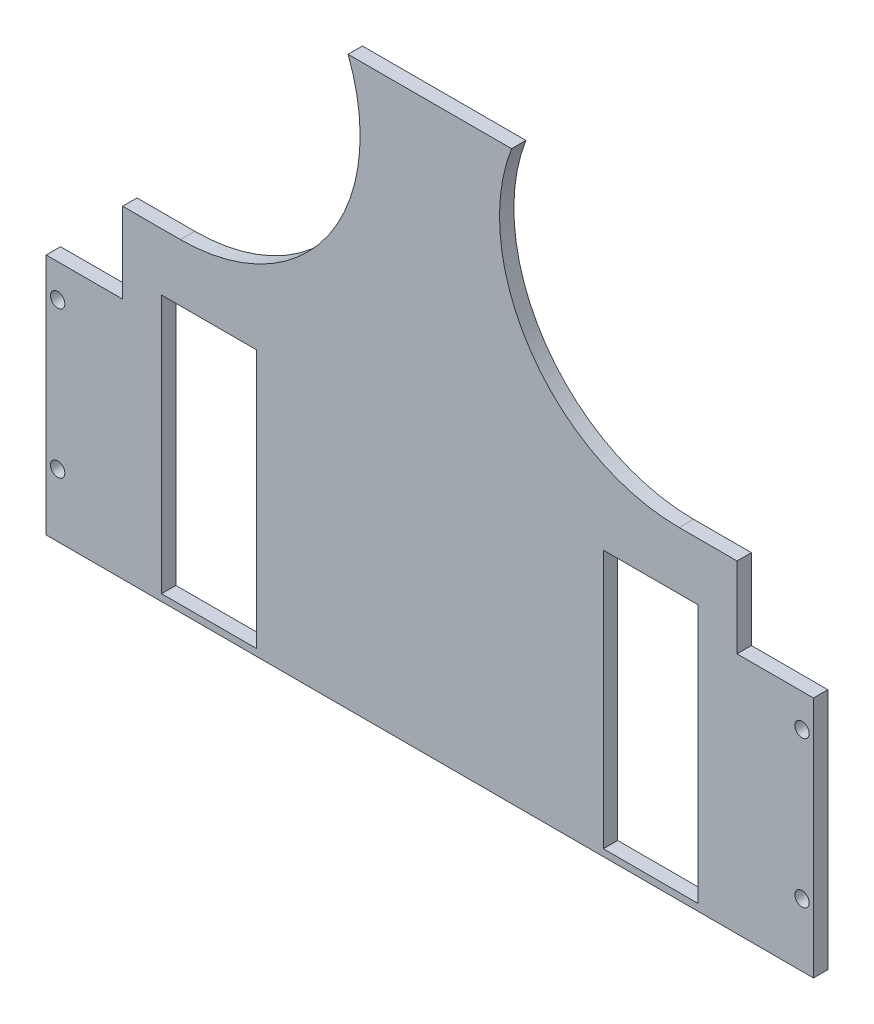
ISO-10303-21;
HEADER;
FILE_DESCRIPTION(('STEP AP214'),'2;1');
FILE_NAME('part.step','',(''),(''),'','','');
FILE_SCHEMA(('AUTOMOTIVE_DESIGN { 1 0 10303 214 1 1 1 1 }'));
ENDSEC;
DATA;
#1=APPLICATION_CONTEXT('core data for automotive mechanical design processes');
#2=APPLICATION_PROTOCOL_DEFINITION('international standard','automotive_design',2000,#1);
#3=PRODUCT_CONTEXT('',#1,'mechanical');
#4=PRODUCT('Part','Part','',(#3));
#5=PRODUCT_RELATED_PRODUCT_CATEGORY('part','',(#4));
#6=PRODUCT_DEFINITION_FORMATION('','',#4);
#7=PRODUCT_DEFINITION_CONTEXT('part definition',#1,'design');
#8=PRODUCT_DEFINITION('design','',#6,#7);
#9=PRODUCT_DEFINITION_SHAPE('','',#8);
#10=(LENGTH_UNIT() NAMED_UNIT(*) SI_UNIT(.MILLI.,.METRE.));
#11=(NAMED_UNIT(*) PLANE_ANGLE_UNIT() SI_UNIT($,.RADIAN.));
#12=(NAMED_UNIT(*) SI_UNIT($,.STERADIAN.) SOLID_ANGLE_UNIT());
#13=UNCERTAINTY_MEASURE_WITH_UNIT(LENGTH_MEASURE(1.E-05),#10,'distance_accuracy_value','');
#14=(GEOMETRIC_REPRESENTATION_CONTEXT(3) GLOBAL_UNCERTAINTY_ASSIGNED_CONTEXT((#13)) GLOBAL_UNIT_ASSIGNED_CONTEXT((#10,
#11,#12)) REPRESENTATION_CONTEXT('',''));
#15=CARTESIAN_POINT('',(0.,0.,0.));
#16=DIRECTION('',(0.,0.,1.));
#17=DIRECTION('',(1.,0.,0.));
#18=AXIS2_PLACEMENT_3D('',#15,#16,#17);
#19=CARTESIAN_POINT('',(0.,0.,5.));
#20=DIRECTION('',(0.,0.,1.));
#21=DIRECTION('',(1.,0.,0.));
#22=AXIS2_PLACEMENT_3D('',#19,#20,#21);
#23=PLANE('',#22);
#24=DIRECTION('',(1.,0.,0.));
#25=VECTOR('',#24,1.);
#26=CARTESIAN_POINT('',(-3395.60000000005,-182.000000000022,5.));
#27=LINE('',#26,#25);
#28=CARTESIAN_POINT('',(-3395.60000000005,-182.000000000022,5.));
#29=VERTEX_POINT('',#28);
#30=CARTESIAN_POINT('',(-3368.99566164202,-182.000000000022,5.));
#31=VERTEX_POINT('',#30);
#32=EDGE_CURVE('E338',#29,#31,#27,.T.);
#33=ORIENTED_EDGE('',*,*,#32,.F.);
#34=DIRECTION('',(0.,-1.,0.));
#35=VECTOR('',#34,1.);
#36=CARTESIAN_POINT('',(-3395.60000000005,-69.0000000000222,5.));
#37=LINE('',#36,#35);
#38=CARTESIAN_POINT('',(-3395.60000000005,-266.375602835039,5.));
#39=VERTEX_POINT('',#38);
#40=EDGE_CURVE('E204',#29,#39,#37,.T.);
#41=ORIENTED_EDGE('',*,*,#40,.T.);
#42=DIRECTION('',(-1.,0.,0.));
#43=VECTOR('',#42,1.);
#44=CARTESIAN_POINT('',(-3395.60000000005,-266.375602835039,5.));
#45=LINE('',#44,#43);
#46=CARTESIAN_POINT('',(-3128.60000000005,-266.375602835039,5.));
#47=VERTEX_POINT('',#46);
#48=EDGE_CURVE('E175',#47,#39,#45,.T.);
#49=ORIENTED_EDGE('',*,*,#48,.F.);
#50=DIRECTION('',(0.,1.,0.));
#51=VECTOR('',#50,1.);
#52=CARTESIAN_POINT('',(-3128.60000000005,-69.0000000000221,5.));
#53=LINE('',#52,#51);
#54=CARTESIAN_POINT('',(-3128.60000000005,-182.000000000022,5.));
#55=VERTEX_POINT('',#54);
#56=EDGE_CURVE('E44',#47,#55,#53,.T.);
#57=ORIENTED_EDGE('',*,*,#56,.T.);
#58=DIRECTION('',(1.,0.,0.));
#59=VECTOR('',#58,1.);
#60=CARTESIAN_POINT('',(-3128.60000000005,-182.000000000022,5.));
#61=LINE('',#60,#59);
#62=CARTESIAN_POINT('',(-3155.20433835807,-182.000000000022,5.));
#63=VERTEX_POINT('',#62);
#64=EDGE_CURVE('E300',#63,#55,#61,.T.);
#65=ORIENTED_EDGE('',*,*,#64,.F.);
#66=DIRECTION('',(0.,-1.,0.));
#67=VECTOR('',#66,1.);
#68=CARTESIAN_POINT('',(-3155.20433835807,-182.000000000022,5.));
#69=LINE('',#68,#67);
#70=CARTESIAN_POINT('',(-3155.20433835807,-154.000000000022,5.));
#71=VERTEX_POINT('',#70);
#72=EDGE_CURVE('E303',#71,#63,#69,.T.);
#73=ORIENTED_EDGE('',*,*,#72,.F.);
#74=DIRECTION('',(1.,0.,0.));
#75=VECTOR('',#74,1.);
#76=CARTESIAN_POINT('',(-3155.20433835807,-154.000000000022,5.));
#77=LINE('',#76,#75);
#78=CARTESIAN_POINT('',(-3175.35039250814,-154.000000000022,5.));
#79=VERTEX_POINT('',#78);
#80=EDGE_CURVE('E306',#79,#71,#77,.T.);
#81=ORIENTED_EDGE('',*,*,#80,.F.);
#82=CARTESIAN_POINT('',(-3175.35039250814,-91.5000000000222,5.));
#83=DIRECTION('',(0.,0.,1.));
#84=DIRECTION('',(-1.,0.,0.));
#85=AXIS2_PLACEMENT_3D('',#82,#83,#84);
#86=CIRCLE('',#85,62.5);
#87=CARTESIAN_POINT('',(-3233.65991145659,-69.0000000000221,5.));
#88=VERTEX_POINT('',#87);
#89=EDGE_CURVE('E180',#88,#79,#86,.T.);
#90=ORIENTED_EDGE('',*,*,#89,.F.);
#91=DIRECTION('',(-1.,0.,0.));
#92=VECTOR('',#91,1.);
#93=CARTESIAN_POINT('',(-3395.60000000005,-69.0000000000222,5.));
#94=LINE('',#93,#92);
#95=CARTESIAN_POINT('',(-3290.5400885435,-69.0000000000221,5.));
#96=VERTEX_POINT('',#95);
#97=EDGE_CURVE('E11',#88,#96,#94,.T.);
#98=ORIENTED_EDGE('',*,*,#97,.T.);
#99=CARTESIAN_POINT('',(-3348.84960749195,-91.5000000000221,5.));
#100=DIRECTION('',(0.,0.,1.));
#101=DIRECTION('',(1.,0.,0.));
#102=AXIS2_PLACEMENT_3D('',#99,#100,#101);
#103=CIRCLE('',#102,62.5);
#104=CARTESIAN_POINT('',(-3348.84960749195,-154.000000000022,5.));
#105=VERTEX_POINT('',#104);
#106=EDGE_CURVE('E60',#105,#96,#103,.T.);
#107=ORIENTED_EDGE('',*,*,#106,.F.);
#108=DIRECTION('',(1.,0.,0.));
#109=VECTOR('',#108,1.);
#110=CARTESIAN_POINT('',(-3368.99566164202,-154.000000000022,5.));
#111=LINE('',#110,#109);
#112=CARTESIAN_POINT('',(-3368.99566164202,-154.000000000022,5.));
#113=VERTEX_POINT('',#112);
#114=EDGE_CURVE('E332',#113,#105,#111,.T.);
#115=ORIENTED_EDGE('',*,*,#114,.F.);
#116=DIRECTION('',(0.,1.,0.));
#117=VECTOR('',#116,1.);
#118=CARTESIAN_POINT('',(-3368.99566164202,-182.000000000022,5.));
#119=LINE('',#118,#117);
#120=EDGE_CURVE('E335',#31,#113,#119,.T.);
#121=ORIENTED_EDGE('',*,*,#120,.F.);
#122=EDGE_LOOP('',(#33,#41,#49,#57,#65,#73,#81,#90,#98,#107,#115,#121));
#123=FACE_BOUND('',#122,.T.);
#124=CARTESIAN_POINT('',(-3391.60000000005,-244.500000000019,5.));
#125=DIRECTION('',(0.,0.,1.));
#126=DIRECTION('',(-1.,0.,0.));
#127=AXIS2_PLACEMENT_3D('',#124,#125,#126);
#128=CIRCLE('',#127,2.50000000000012);
#129=CARTESIAN_POINT('',(-3394.10000000005,-244.500000000019,5.));
#130=VERTEX_POINT('',#129);
#131=EDGE_CURVE('E243',#130,#130,#128,.T.);
#132=ORIENTED_EDGE('',*,*,#131,.F.);
#133=EDGE_LOOP('',(#132));
#134=FACE_BOUND('',#133,.T.);
#135=CARTESIAN_POINT('',(-3132.60000000005,-193.500000000019,5.));
#136=DIRECTION('',(0.,0.,1.));
#137=DIRECTION('',(1.,0.,0.));
#138=AXIS2_PLACEMENT_3D('',#135,#136,#137);
#139=CIRCLE('',#138,2.50000000000012);
#140=CARTESIAN_POINT('',(-3130.10000000005,-193.500000000019,5.));
#141=VERTEX_POINT('',#140);
#142=EDGE_CURVE('E226',#141,#141,#139,.T.);
#143=ORIENTED_EDGE('',*,*,#142,.F.);
#144=EDGE_LOOP('',(#143));
#145=FACE_BOUND('',#144,.T.);
#146=DIRECTION('',(1.,0.,0.));
#147=VECTOR('',#146,1.);
#148=CARTESIAN_POINT('',(-3201.74000000005,-264.00000000002,5.));
#149=LINE('',#148,#147);
#150=CARTESIAN_POINT('',(-3201.74000000005,-264.00000000002,5.));
#151=VERTEX_POINT('',#150);
#152=CARTESIAN_POINT('',(-3168.74000000005,-264.00000000002,5.));
#153=VERTEX_POINT('',#152);
#154=EDGE_CURVE('E231',#151,#153,#149,.T.);
#155=ORIENTED_EDGE('',*,*,#154,.F.);
#156=DIRECTION('',(0.,-1.,0.));
#157=VECTOR('',#156,1.);
#158=CARTESIAN_POINT('',(-3201.74000000005,-174.000000000017,5.));
#159=LINE('',#158,#157);
#160=CARTESIAN_POINT('',(-3201.74000000005,-174.000000000017,5.));
#161=VERTEX_POINT('',#160);
#162=EDGE_CURVE('E216',#161,#151,#159,.T.);
#163=ORIENTED_EDGE('',*,*,#162,.F.);
#164=DIRECTION('',(-1.,1.02611521972931E-13,0.));
#165=VECTOR('',#164,1.);
#166=CARTESIAN_POINT('',(-3201.74000000005,-174.000000000017,5.));
#167=LINE('',#166,#165);
#168=CARTESIAN_POINT('',(-3168.74000000005,-174.00000000002,5.));
#169=VERTEX_POINT('',#168);
#170=EDGE_CURVE('E212',#169,#161,#167,.T.);
#171=ORIENTED_EDGE('',*,*,#170,.F.);
#172=DIRECTION('',(0.,1.,0.));
#173=VECTOR('',#172,1.);
#174=CARTESIAN_POINT('',(-3168.74000000005,-174.00000000002,5.));
#175=LINE('',#174,#173);
#176=EDGE_CURVE('E228',#153,#169,#175,.T.);
#177=ORIENTED_EDGE('',*,*,#176,.F.);
#178=EDGE_LOOP('',(#155,#163,#171,#177));
#179=FACE_BOUND('',#178,.T.);
#180=CARTESIAN_POINT('',(-3132.60000000005,-244.500000000019,5.));
#181=DIRECTION('',(0.,0.,1.));
#182=DIRECTION('',(1.,0.,0.));
#183=AXIS2_PLACEMENT_3D('',#180,#181,#182);
#184=CIRCLE('',#183,2.50000000000012);
#185=CARTESIAN_POINT('',(-3130.10000000005,-244.500000000019,5.));
#186=VERTEX_POINT('',#185);
#187=EDGE_CURVE('E237',#186,#186,#184,.T.);
#188=ORIENTED_EDGE('',*,*,#187,.F.);
#189=EDGE_LOOP('',(#188));
#190=FACE_BOUND('',#189,.T.);
#191=CARTESIAN_POINT('',(-3391.60000000005,-193.500000000019,5.));
#192=DIRECTION('',(0.,0.,1.));
#193=DIRECTION('',(-1.,0.,0.));
#194=AXIS2_PLACEMENT_3D('',#191,#192,#193);
#195=CIRCLE('',#194,2.50000000000012);
#196=CARTESIAN_POINT('',(-3394.10000000005,-193.500000000019,5.));
#197=VERTEX_POINT('',#196);
#198=EDGE_CURVE('E249',#197,#197,#195,.T.);
#199=ORIENTED_EDGE('',*,*,#198,.F.);
#200=EDGE_LOOP('',(#199));
#201=FACE_BOUND('',#200,.T.);
#202=DIRECTION('',(0.,-1.,0.));
#203=VECTOR('',#202,1.);
#204=CARTESIAN_POINT('',(-3355.46000000005,-174.00000000002,5.));
#205=LINE('',#204,#203);
#206=CARTESIAN_POINT('',(-3355.46000000005,-174.00000000002,5.));
#207=VERTEX_POINT('',#206);
#208=CARTESIAN_POINT('',(-3355.46000000005,-264.000000000017,5.));
#209=VERTEX_POINT('',#208);
#210=EDGE_CURVE('E286',#207,#209,#205,.T.);
#211=ORIENTED_EDGE('',*,*,#210,.F.);
#212=DIRECTION('',(-1.,-1.02611521972931E-13,0.));
#213=VECTOR('',#212,1.);
#214=CARTESIAN_POINT('',(-3322.46000000005,-174.000000000017,5.));
#215=LINE('',#214,#213);
#216=CARTESIAN_POINT('',(-3322.46000000005,-174.000000000017,5.));
#217=VERTEX_POINT('',#216);
#218=EDGE_CURVE('E271',#217,#207,#215,.T.);
#219=ORIENTED_EDGE('',*,*,#218,.F.);
#220=DIRECTION('',(0.,1.,0.));
#221=VECTOR('',#220,1.);
#222=CARTESIAN_POINT('',(-3322.46000000005,-174.000000000017,5.));
#223=LINE('',#222,#221);
#224=CARTESIAN_POINT('',(-3322.46000000005,-264.00000000002,5.));
#225=VERTEX_POINT('',#224);
#226=EDGE_CURVE('E267',#225,#217,#223,.T.);
#227=ORIENTED_EDGE('',*,*,#226,.F.);
#228=DIRECTION('',(1.,-1.04293678070848E-13,0.));
#229=VECTOR('',#228,1.);
#230=CARTESIAN_POINT('',(-3322.46000000005,-264.00000000002,5.));
#231=LINE('',#230,#229);
#232=EDGE_CURVE('E283',#209,#225,#231,.T.);
#233=ORIENTED_EDGE('',*,*,#232,.F.);
#234=EDGE_LOOP('',(#211,#219,#227,#233));
#235=FACE_BOUND('',#234,.T.);
#236=ADVANCED_FACE('F35',(#123,#134,#145,#179,#190,#201,#235),#23,.T.);
#237=CARTESIAN_POINT('',(0.,0.,0.));
#238=DIRECTION('',(0.,0.,1.));
#239=DIRECTION('',(1.,0.,0.));
#240=AXIS2_PLACEMENT_3D('',#237,#238,#239);
#241=PLANE('',#240);
#242=DIRECTION('',(0.,-1.,0.));
#243=VECTOR('',#242,1.);
#244=CARTESIAN_POINT('',(-3395.60000000005,-69.0000000000222,0.));
#245=LINE('',#244,#243);
#246=CARTESIAN_POINT('',(-3395.60000000005,-182.000000000022,0.));
#247=VERTEX_POINT('',#246);
#248=CARTESIAN_POINT('',(-3395.60000000005,-266.375602835039,0.));
#249=VERTEX_POINT('',#248);
#250=EDGE_CURVE('E189',#247,#249,#245,.T.);
#251=ORIENTED_EDGE('',*,*,#250,.F.);
#252=DIRECTION('',(1.,0.,0.));
#253=VECTOR('',#252,1.);
#254=CARTESIAN_POINT('',(-3395.60000000005,-182.000000000022,0.));
#255=LINE('',#254,#253);
#256=CARTESIAN_POINT('',(-3368.99566164202,-182.000000000022,0.));
#257=VERTEX_POINT('',#256);
#258=EDGE_CURVE('E331',#247,#257,#255,.T.);
#259=ORIENTED_EDGE('',*,*,#258,.T.);
#260=DIRECTION('',(0.,1.,0.));
#261=VECTOR('',#260,1.);
#262=CARTESIAN_POINT('',(-3368.99566164202,-182.000000000022,0.));
#263=LINE('',#262,#261);
#264=CARTESIAN_POINT('',(-3368.99566164202,-154.000000000022,0.));
#265=VERTEX_POINT('',#264);
#266=EDGE_CURVE('E346',#257,#265,#263,.T.);
#267=ORIENTED_EDGE('',*,*,#266,.T.);
#268=DIRECTION('',(1.,0.,0.));
#269=VECTOR('',#268,1.);
#270=CARTESIAN_POINT('',(-3368.99566164202,-154.000000000022,0.));
#271=LINE('',#270,#269);
#272=CARTESIAN_POINT('',(-3348.84960749195,-154.000000000022,0.));
#273=VERTEX_POINT('',#272);
#274=EDGE_CURVE('E343',#265,#273,#271,.T.);
#275=ORIENTED_EDGE('',*,*,#274,.T.);
#276=CARTESIAN_POINT('',(-3348.84960749195,-91.5000000000221,0.));
#277=DIRECTION('',(0.,0.,1.));
#278=DIRECTION('',(1.,0.,0.));
#279=AXIS2_PLACEMENT_3D('',#276,#277,#278);
#280=CIRCLE('',#279,62.5);
#281=CARTESIAN_POINT('',(-3290.5400885435,-69.0000000000221,0.));
#282=VERTEX_POINT('',#281);
#283=EDGE_CURVE('E323',#273,#282,#280,.T.);
#284=ORIENTED_EDGE('',*,*,#283,.T.);
#285=DIRECTION('',(-1.,0.,0.));
#286=VECTOR('',#285,1.);
#287=CARTESIAN_POINT('',(-3395.60000000005,-69.0000000000222,0.));
#288=LINE('',#287,#286);
#289=CARTESIAN_POINT('',(-3233.65991145659,-69.0000000000221,0.));
#290=VERTEX_POINT('',#289);
#291=EDGE_CURVE('E39',#290,#282,#288,.T.);
#292=ORIENTED_EDGE('',*,*,#291,.F.);
#293=CARTESIAN_POINT('',(-3175.35039250814,-91.5000000000222,0.));
#294=DIRECTION('',(0.,0.,1.));
#295=DIRECTION('',(-1.,0.,0.));
#296=AXIS2_PLACEMENT_3D('',#293,#294,#295);
#297=CIRCLE('',#296,62.5);
#298=CARTESIAN_POINT('',(-3175.35039250814,-154.000000000022,0.));
#299=VERTEX_POINT('',#298);
#300=EDGE_CURVE('E302',#290,#299,#297,.T.);
#301=ORIENTED_EDGE('',*,*,#300,.T.);
#302=DIRECTION('',(1.,0.,0.));
#303=VECTOR('',#302,1.);
#304=CARTESIAN_POINT('',(-3155.20433835807,-154.000000000022,0.));
#305=LINE('',#304,#303);
#306=CARTESIAN_POINT('',(-3155.20433835807,-154.000000000022,0.));
#307=VERTEX_POINT('',#306);
#308=EDGE_CURVE('E315',#299,#307,#305,.T.);
#309=ORIENTED_EDGE('',*,*,#308,.T.);
#310=DIRECTION('',(0.,-1.,0.));
#311=VECTOR('',#310,1.);
#312=CARTESIAN_POINT('',(-3155.20433835807,-182.000000000022,0.));
#313=LINE('',#312,#311);
#314=CARTESIAN_POINT('',(-3155.20433835807,-182.000000000022,0.));
#315=VERTEX_POINT('',#314);
#316=EDGE_CURVE('E312',#307,#315,#313,.T.);
#317=ORIENTED_EDGE('',*,*,#316,.T.);
#318=DIRECTION('',(1.,0.,0.));
#319=VECTOR('',#318,1.);
#320=CARTESIAN_POINT('',(-3128.60000000005,-182.000000000022,0.));
#321=LINE('',#320,#319);
#322=CARTESIAN_POINT('',(-3128.60000000005,-182.000000000022,0.));
#323=VERTEX_POINT('',#322);
#324=EDGE_CURVE('E292',#315,#323,#321,.T.);
#325=ORIENTED_EDGE('',*,*,#324,.T.);
#326=DIRECTION('',(0.,1.,0.));
#327=VECTOR('',#326,1.);
#328=CARTESIAN_POINT('',(-3128.60000000005,-69.0000000000221,0.));
#329=LINE('',#328,#327);
#330=CARTESIAN_POINT('',(-3128.60000000005,-266.375602835039,0.));
#331=VERTEX_POINT('',#330);
#332=EDGE_CURVE('E192',#331,#323,#329,.T.);
#333=ORIENTED_EDGE('',*,*,#332,.F.);
#334=DIRECTION('',(-1.,0.,0.));
#335=VECTOR('',#334,1.);
#336=CARTESIAN_POINT('',(-3395.60000000005,-266.375602835039,0.));
#337=LINE('',#336,#335);
#338=EDGE_CURVE('E52',#331,#249,#337,.T.);
#339=ORIENTED_EDGE('',*,*,#338,.T.);
#340=EDGE_LOOP('',(#251,#259,#267,#275,#284,#292,#301,#309,#317,#325,#333,#339));
#341=FACE_BOUND('',#340,.T.);
#342=CARTESIAN_POINT('',(-3391.60000000005,-193.500000000019,0.));
#343=DIRECTION('',(0.,0.,1.));
#344=DIRECTION('',(-1.,0.,0.));
#345=AXIS2_PLACEMENT_3D('',#342,#343,#344);
#346=CIRCLE('',#345,2.50000000000012);
#347=CARTESIAN_POINT('',(-3394.10000000005,-193.500000000019,0.));
#348=VERTEX_POINT('',#347);
#349=EDGE_CURVE('E252',#348,#348,#346,.T.);
#350=ORIENTED_EDGE('',*,*,#349,.T.);
#351=EDGE_LOOP('',(#350));
#352=FACE_BOUND('',#351,.T.);
#353=CARTESIAN_POINT('',(-3391.60000000005,-244.500000000019,0.));
#354=DIRECTION('',(0.,0.,1.));
#355=DIRECTION('',(-1.,0.,0.));
#356=AXIS2_PLACEMENT_3D('',#353,#354,#355);
#357=CIRCLE('',#356,2.50000000000012);
#358=CARTESIAN_POINT('',(-3394.10000000005,-244.500000000019,0.));
#359=VERTEX_POINT('',#358);
#360=EDGE_CURVE('E246',#359,#359,#357,.T.);
#361=ORIENTED_EDGE('',*,*,#360,.T.);
#362=EDGE_LOOP('',(#361));
#363=FACE_BOUND('',#362,.T.);
#364=CARTESIAN_POINT('',(-3132.60000000005,-244.500000000019,0.));
#365=DIRECTION('',(0.,0.,1.));
#366=DIRECTION('',(1.,0.,0.));
#367=AXIS2_PLACEMENT_3D('',#364,#365,#366);
#368=CIRCLE('',#367,2.50000000000012);
#369=CARTESIAN_POINT('',(-3130.10000000005,-244.500000000019,0.));
#370=VERTEX_POINT('',#369);
#371=EDGE_CURVE('E240',#370,#370,#368,.T.);
#372=ORIENTED_EDGE('',*,*,#371,.T.);
#373=EDGE_LOOP('',(#372));
#374=FACE_BOUND('',#373,.T.);
#375=CARTESIAN_POINT('',(-3132.60000000005,-193.500000000019,0.));
#376=DIRECTION('',(0.,0.,1.));
#377=DIRECTION('',(1.,0.,0.));
#378=AXIS2_PLACEMENT_3D('',#375,#376,#377);
#379=CIRCLE('',#378,2.50000000000012);
#380=CARTESIAN_POINT('',(-3130.10000000005,-193.500000000019,0.));
#381=VERTEX_POINT('',#380);
#382=EDGE_CURVE('E234',#381,#381,#379,.T.);
#383=ORIENTED_EDGE('',*,*,#382,.T.);
#384=EDGE_LOOP('',(#383));
#385=FACE_BOUND('',#384,.T.);
#386=DIRECTION('',(0.,-1.,0.));
#387=VECTOR('',#386,1.);
#388=CARTESIAN_POINT('',(-3201.74000000005,-174.000000000017,0.));
#389=LINE('',#388,#387);
#390=CARTESIAN_POINT('',(-3201.74000000005,-174.000000000017,0.));
#391=VERTEX_POINT('',#390);
#392=CARTESIAN_POINT('',(-3201.74000000005,-264.00000000002,0.));
#393=VERTEX_POINT('',#392);
#394=EDGE_CURVE('E223',#391,#393,#389,.T.);
#395=ORIENTED_EDGE('',*,*,#394,.T.);
#396=DIRECTION('',(1.,0.,0.));
#397=VECTOR('',#396,1.);
#398=CARTESIAN_POINT('',(-3201.74000000005,-264.00000000002,0.));
#399=LINE('',#398,#397);
#400=CARTESIAN_POINT('',(-3168.74000000005,-264.00000000002,0.));
#401=VERTEX_POINT('',#400);
#402=EDGE_CURVE('E220',#393,#401,#399,.T.);
#403=ORIENTED_EDGE('',*,*,#402,.T.);
#404=DIRECTION('',(0.,1.,0.));
#405=VECTOR('',#404,1.);
#406=CARTESIAN_POINT('',(-3168.74000000005,-174.00000000002,0.));
#407=LINE('',#406,#405);
#408=CARTESIAN_POINT('',(-3168.74000000005,-174.00000000002,0.));
#409=VERTEX_POINT('',#408);
#410=EDGE_CURVE('E217',#401,#409,#407,.T.);
#411=ORIENTED_EDGE('',*,*,#410,.T.);
#412=DIRECTION('',(-1.,1.02611521972931E-13,0.));
#413=VECTOR('',#412,1.);
#414=CARTESIAN_POINT('',(-3201.74000000005,-174.000000000017,0.));
#415=LINE('',#414,#413);
#416=EDGE_CURVE('E213',#409,#391,#415,.T.);
#417=ORIENTED_EDGE('',*,*,#416,.T.);
#418=EDGE_LOOP('',(#395,#403,#411,#417));
#419=FACE_BOUND('',#418,.T.);
#420=DIRECTION('',(-1.,-1.02611521972931E-13,0.));
#421=VECTOR('',#420,1.);
#422=CARTESIAN_POINT('',(-3322.46000000005,-174.000000000017,0.));
#423=LINE('',#422,#421);
#424=CARTESIAN_POINT('',(-3322.46000000005,-174.000000000017,0.));
#425=VERTEX_POINT('',#424);
#426=CARTESIAN_POINT('',(-3355.46000000005,-174.00000000002,0.));
#427=VERTEX_POINT('',#426);
#428=EDGE_CURVE('E278',#425,#427,#423,.T.);
#429=ORIENTED_EDGE('',*,*,#428,.T.);
#430=DIRECTION('',(0.,-1.,0.));
#431=VECTOR('',#430,1.);
#432=CARTESIAN_POINT('',(-3355.46000000005,-174.00000000002,0.));
#433=LINE('',#432,#431);
#434=CARTESIAN_POINT('',(-3355.46000000005,-264.000000000017,0.));
#435=VERTEX_POINT('',#434);
#436=EDGE_CURVE('E275',#427,#435,#433,.T.);
#437=ORIENTED_EDGE('',*,*,#436,.T.);
#438=DIRECTION('',(1.,-1.04293678070848E-13,0.));
#439=VECTOR('',#438,1.);
#440=CARTESIAN_POINT('',(-3322.46000000005,-264.00000000002,0.));
#441=LINE('',#440,#439);
#442=CARTESIAN_POINT('',(-3322.46000000005,-264.00000000002,0.));
#443=VERTEX_POINT('',#442);
#444=EDGE_CURVE('E272',#435,#443,#441,.T.);
#445=ORIENTED_EDGE('',*,*,#444,.T.);
#446=DIRECTION('',(0.,1.,0.));
#447=VECTOR('',#446,1.);
#448=CARTESIAN_POINT('',(-3322.46000000005,-174.000000000017,0.));
#449=LINE('',#448,#447);
#450=EDGE_CURVE('E268',#443,#425,#449,.T.);
#451=ORIENTED_EDGE('',*,*,#450,.T.);
#452=EDGE_LOOP('',(#429,#437,#445,#451));
#453=FACE_BOUND('',#452,.T.);
#454=ADVANCED_FACE('F186',(#341,#352,#363,#374,#385,#419,#453),#241,.F.);
#455=CARTESIAN_POINT('',(-3395.60000000005,-69.0000000000222,5.));
#456=DIRECTION('',(1.,0.,0.));
#457=DIRECTION('',(0.,0.,-1.));
#458=AXIS2_PLACEMENT_3D('',#455,#456,#457);
#459=PLANE('',#458);
#460=ORIENTED_EDGE('',*,*,#40,.F.);
#461=DIRECTION('',(0.,0.,1.));
#462=VECTOR('',#461,1.);
#463=CARTESIAN_POINT('',(-3395.60000000005,-182.000000000022,0.));
#464=LINE('',#463,#462);
#465=EDGE_CURVE('E195',#247,#29,#464,.T.);
#466=ORIENTED_EDGE('',*,*,#465,.F.);
#467=ORIENTED_EDGE('',*,*,#250,.T.);
#468=DIRECTION('',(0.,0.,1.));
#469=VECTOR('',#468,1.);
#470=CARTESIAN_POINT('',(-3395.60000000005,-266.375602835039,0.));
#471=LINE('',#470,#469);
#472=EDGE_CURVE('E172',#249,#39,#471,.T.);
#473=ORIENTED_EDGE('',*,*,#472,.T.);
#474=EDGE_LOOP('',(#460,#466,#467,#473));
#475=FACE_BOUND('',#474,.T.);
#476=ADVANCED_FACE('F37',(#475),#459,.F.);
#477=CARTESIAN_POINT('',(-3128.60000000005,-69.0000000000221,5.));
#478=DIRECTION('',(-1.,0.,0.));
#479=DIRECTION('',(0.,0.,1.));
#480=AXIS2_PLACEMENT_3D('',#477,#478,#479);
#481=PLANE('',#480);
#482=ORIENTED_EDGE('',*,*,#56,.F.);
#483=DIRECTION('',(0.,0.,1.));
#484=VECTOR('',#483,1.);
#485=CARTESIAN_POINT('',(-3128.60000000005,-266.375602835039,0.));
#486=LINE('',#485,#484);
#487=EDGE_CURVE('E181',#331,#47,#486,.T.);
#488=ORIENTED_EDGE('',*,*,#487,.F.);
#489=ORIENTED_EDGE('',*,*,#332,.T.);
#490=DIRECTION('',(0.,0.,1.));
#491=VECTOR('',#490,1.);
#492=CARTESIAN_POINT('',(-3128.60000000005,-182.000000000022,0.));
#493=LINE('',#492,#491);
#494=EDGE_CURVE('E296',#323,#55,#493,.T.);
#495=ORIENTED_EDGE('',*,*,#494,.T.);
#496=EDGE_LOOP('',(#482,#488,#489,#495));
#497=FACE_BOUND('',#496,.T.);
#498=ADVANCED_FACE('F357',(#497),#481,.F.);
#499=CARTESIAN_POINT('',(-3395.60000000005,-69.0000000000222,5.));
#500=DIRECTION('',(0.,-1.,0.));
#501=DIRECTION('',(1.,0.,0.));
#502=AXIS2_PLACEMENT_3D('',#499,#500,#501);
#503=PLANE('',#502);
#504=ORIENTED_EDGE('',*,*,#291,.T.);
#505=DIRECTION('',(0.,0.,1.));
#506=VECTOR('',#505,1.);
#507=CARTESIAN_POINT('',(-3290.5400885435,-69.0000000000221,0.));
#508=LINE('',#507,#506);
#509=EDGE_CURVE('E327',#282,#96,#508,.T.);
#510=ORIENTED_EDGE('',*,*,#509,.T.);
#511=ORIENTED_EDGE('',*,*,#97,.F.);
#512=DIRECTION('',(0.,0.,1.));
#513=VECTOR('',#512,1.);
#514=CARTESIAN_POINT('',(-3233.65991145659,-69.0000000000221,0.));
#515=LINE('',#514,#513);
#516=EDGE_CURVE('E281',#290,#88,#515,.T.);
#517=ORIENTED_EDGE('',*,*,#516,.F.);
#518=EDGE_LOOP('',(#504,#510,#511,#517));
#519=FACE_BOUND('',#518,.T.);
#520=ADVANCED_FACE('F377',(#519),#503,.F.);
#521=CARTESIAN_POINT('',(-3201.74000000005,-174.000000000017,5.));
#522=DIRECTION('',(1.,0.,0.));
#523=DIRECTION('',(0.,0.,-1.));
#524=AXIS2_PLACEMENT_3D('',#521,#522,#523);
#525=PLANE('',#524);
#526=ORIENTED_EDGE('',*,*,#394,.F.);
#527=DIRECTION('',(0.,0.,-1.));
#528=VECTOR('',#527,1.);
#529=CARTESIAN_POINT('',(-3201.74000000005,-174.000000000017,5.));
#530=LINE('',#529,#528);
#531=EDGE_CURVE('E209',#161,#391,#530,.T.);
#532=ORIENTED_EDGE('',*,*,#531,.F.);
#533=ORIENTED_EDGE('',*,*,#162,.T.);
#534=DIRECTION('',(0.,0.,-1.));
#535=VECTOR('',#534,1.);
#536=CARTESIAN_POINT('',(-3201.74000000005,-264.00000000002,5.));
#537=LINE('',#536,#535);
#538=EDGE_CURVE('E196',#151,#393,#537,.T.);
#539=ORIENTED_EDGE('',*,*,#538,.T.);
#540=EDGE_LOOP('',(#526,#532,#533,#539));
#541=FACE_BOUND('',#540,.T.);
#542=ADVANCED_FACE('F407',(#541),#525,.T.);
#543=CARTESIAN_POINT('',(-3201.74000000005,-264.00000000002,5.));
#544=DIRECTION('',(0.,1.,0.));
#545=DIRECTION('',(0.,0.,1.));
#546=AXIS2_PLACEMENT_3D('',#543,#544,#545);
#547=PLANE('',#546);
#548=ORIENTED_EDGE('',*,*,#402,.F.);
#549=ORIENTED_EDGE('',*,*,#538,.F.);
#550=ORIENTED_EDGE('',*,*,#154,.T.);
#551=DIRECTION('',(0.,0.,-1.));
#552=VECTOR('',#551,1.);
#553=CARTESIAN_POINT('',(-3168.74000000005,-264.00000000002,5.));
#554=LINE('',#553,#552);
#555=EDGE_CURVE('E199',#153,#401,#554,.T.);
#556=ORIENTED_EDGE('',*,*,#555,.T.);
#557=EDGE_LOOP('',(#548,#549,#550,#556));
#558=FACE_BOUND('',#557,.T.);
#559=ADVANCED_FACE('F527',(#558),#547,.T.);
#560=CARTESIAN_POINT('',(-3168.74000000005,-174.00000000002,5.));
#561=DIRECTION('',(-1.,0.,0.));
#562=DIRECTION('',(0.,0.,1.));
#563=AXIS2_PLACEMENT_3D('',#560,#561,#562);
#564=PLANE('',#563);
#565=ORIENTED_EDGE('',*,*,#410,.F.);
#566=ORIENTED_EDGE('',*,*,#555,.F.);
#567=ORIENTED_EDGE('',*,*,#176,.T.);
#568=DIRECTION('',(0.,0.,-1.));
#569=VECTOR('',#568,1.);
#570=CARTESIAN_POINT('',(-3168.74000000005,-174.00000000002,5.));
#571=LINE('',#570,#569);
#572=EDGE_CURVE('E207',#169,#409,#571,.T.);
#573=ORIENTED_EDGE('',*,*,#572,.T.);
#574=EDGE_LOOP('',(#565,#566,#567,#573));
#575=FACE_BOUND('',#574,.T.);
#576=ADVANCED_FACE('F517',(#575),#564,.T.);
#577=CARTESIAN_POINT('',(-3201.74000000005,-174.000000000017,5.));
#578=DIRECTION('',(-1.02611521972931E-13,-1.,0.));
#579=DIRECTION('',(1.,-1.02611521972931E-13,0.));
#580=AXIS2_PLACEMENT_3D('',#577,#578,#579);
#581=PLANE('',#580);
#582=ORIENTED_EDGE('',*,*,#416,.F.);
#583=ORIENTED_EDGE('',*,*,#572,.F.);
#584=ORIENTED_EDGE('',*,*,#170,.T.);
#585=ORIENTED_EDGE('',*,*,#531,.T.);
#586=EDGE_LOOP('',(#582,#583,#584,#585));
#587=FACE_BOUND('',#586,.T.);
#588=ADVANCED_FACE('F507',(#587),#581,.T.);
#589=CARTESIAN_POINT('',(-3132.60000000005,-193.500000000019,5.));
#590=DIRECTION('',(0.,0.,-1.));
#591=DIRECTION('',(-1.,0.,0.));
#592=AXIS2_PLACEMENT_3D('',#589,#590,#591);
#593=CYLINDRICAL_SURFACE('',#592,2.50000000000012);
#594=ORIENTED_EDGE('',*,*,#142,.T.);
#595=EDGE_LOOP('',(#594));
#596=FACE_BOUND('',#595,.T.);
#597=ORIENTED_EDGE('',*,*,#382,.F.);
#598=EDGE_LOOP('',(#597));
#599=FACE_BOUND('',#598,.T.);
#600=ADVANCED_FACE('F497',(#596,#599),#593,.F.);
#601=CARTESIAN_POINT('',(-3132.60000000005,-244.500000000019,5.));
#602=DIRECTION('',(0.,0.,-1.));
#603=DIRECTION('',(-1.,0.,0.));
#604=AXIS2_PLACEMENT_3D('',#601,#602,#603);
#605=CYLINDRICAL_SURFACE('',#604,2.50000000000012);
#606=ORIENTED_EDGE('',*,*,#187,.T.);
#607=EDGE_LOOP('',(#606));
#608=FACE_BOUND('',#607,.T.);
#609=ORIENTED_EDGE('',*,*,#371,.F.);
#610=EDGE_LOOP('',(#609));
#611=FACE_BOUND('',#610,.T.);
#612=ADVANCED_FACE('F487',(#608,#611),#605,.F.);
#613=CARTESIAN_POINT('',(-3391.60000000005,-244.500000000019,5.));
#614=DIRECTION('',(0.,0.,-1.));
#615=DIRECTION('',(-1.,0.,0.));
#616=AXIS2_PLACEMENT_3D('',#613,#614,#615);
#617=CYLINDRICAL_SURFACE('',#616,2.50000000000012);
#618=ORIENTED_EDGE('',*,*,#131,.T.);
#619=EDGE_LOOP('',(#618));
#620=FACE_BOUND('',#619,.T.);
#621=ORIENTED_EDGE('',*,*,#360,.F.);
#622=EDGE_LOOP('',(#621));
#623=FACE_BOUND('',#622,.T.);
#624=ADVANCED_FACE('F477',(#620,#623),#617,.F.);
#625=CARTESIAN_POINT('',(-3391.60000000005,-193.500000000019,5.));
#626=DIRECTION('',(0.,0.,-1.));
#627=DIRECTION('',(-1.,0.,0.));
#628=AXIS2_PLACEMENT_3D('',#625,#626,#627);
#629=CYLINDRICAL_SURFACE('',#628,2.50000000000012);
#630=ORIENTED_EDGE('',*,*,#198,.T.);
#631=EDGE_LOOP('',(#630));
#632=FACE_BOUND('',#631,.T.);
#633=ORIENTED_EDGE('',*,*,#349,.F.);
#634=EDGE_LOOP('',(#633));
#635=FACE_BOUND('',#634,.T.);
#636=ADVANCED_FACE('F467',(#632,#635),#629,.F.);
#637=CARTESIAN_POINT('',(-3322.46000000005,-174.000000000017,5.));
#638=DIRECTION('',(1.02611521972931E-13,-1.,0.));
#639=DIRECTION('',(1.,1.02611521972931E-13,0.));
#640=AXIS2_PLACEMENT_3D('',#637,#638,#639);
#641=PLANE('',#640);
#642=ORIENTED_EDGE('',*,*,#428,.F.);
#643=DIRECTION('',(0.,0.,-1.));
#644=VECTOR('',#643,1.);
#645=CARTESIAN_POINT('',(-3322.46000000005,-174.000000000017,5.));
#646=LINE('',#645,#644);
#647=EDGE_CURVE('E264',#217,#425,#646,.T.);
#648=ORIENTED_EDGE('',*,*,#647,.F.);
#649=ORIENTED_EDGE('',*,*,#218,.T.);
#650=DIRECTION('',(0.,0.,-1.));
#651=VECTOR('',#650,1.);
#652=CARTESIAN_POINT('',(-3355.46000000005,-174.00000000002,5.));
#653=LINE('',#652,#651);
#654=EDGE_CURVE('E255',#207,#427,#653,.T.);
#655=ORIENTED_EDGE('',*,*,#654,.T.);
#656=EDGE_LOOP('',(#642,#648,#649,#655));
#657=FACE_BOUND('',#656,.T.);
#658=ADVANCED_FACE('F457',(#657),#641,.T.);
#659=CARTESIAN_POINT('',(-3355.46000000005,-174.00000000002,5.));
#660=DIRECTION('',(1.,0.,0.));
#661=DIRECTION('',(0.,0.,-1.));
#662=AXIS2_PLACEMENT_3D('',#659,#660,#661);
#663=PLANE('',#662);
#664=ORIENTED_EDGE('',*,*,#436,.F.);
#665=ORIENTED_EDGE('',*,*,#654,.F.);
#666=ORIENTED_EDGE('',*,*,#210,.T.);
#667=DIRECTION('',(0.,0.,-1.));
#668=VECTOR('',#667,1.);
#669=CARTESIAN_POINT('',(-3355.46000000005,-264.000000000017,5.));
#670=LINE('',#669,#668);
#671=EDGE_CURVE('E260',#209,#435,#670,.T.);
#672=ORIENTED_EDGE('',*,*,#671,.T.);
#673=EDGE_LOOP('',(#664,#665,#666,#672));
#674=FACE_BOUND('',#673,.T.);
#675=ADVANCED_FACE('F447',(#674),#663,.T.);
#676=CARTESIAN_POINT('',(-3322.46000000005,-264.00000000002,5.));
#677=DIRECTION('',(1.04293678070848E-13,1.,0.));
#678=DIRECTION('',(-1.,1.04293678070848E-13,0.));
#679=AXIS2_PLACEMENT_3D('',#676,#677,#678);
#680=PLANE('',#679);
#681=ORIENTED_EDGE('',*,*,#444,.F.);
#682=ORIENTED_EDGE('',*,*,#671,.F.);
#683=ORIENTED_EDGE('',*,*,#232,.T.);
#684=DIRECTION('',(0.,0.,-1.));
#685=VECTOR('',#684,1.);
#686=CARTESIAN_POINT('',(-3322.46000000005,-264.00000000002,5.));
#687=LINE('',#686,#685);
#688=EDGE_CURVE('E262',#225,#443,#687,.T.);
#689=ORIENTED_EDGE('',*,*,#688,.T.);
#690=EDGE_LOOP('',(#681,#682,#683,#689));
#691=FACE_BOUND('',#690,.T.);
#692=ADVANCED_FACE('F435',(#691),#680,.T.);
#693=CARTESIAN_POINT('',(-3322.46000000005,-174.000000000017,5.));
#694=DIRECTION('',(-1.,0.,0.));
#695=DIRECTION('',(0.,0.,1.));
#696=AXIS2_PLACEMENT_3D('',#693,#694,#695);
#697=PLANE('',#696);
#698=ORIENTED_EDGE('',*,*,#450,.F.);
#699=ORIENTED_EDGE('',*,*,#688,.F.);
#700=ORIENTED_EDGE('',*,*,#226,.T.);
#701=ORIENTED_EDGE('',*,*,#647,.T.);
#702=EDGE_LOOP('',(#698,#699,#700,#701));
#703=FACE_BOUND('',#702,.T.);
#704=ADVANCED_FACE('F430',(#703),#697,.T.);
#705=CARTESIAN_POINT('',(-3175.35039250814,-91.5000000000222,0.));
#706=DIRECTION('',(0.,0.,1.));
#707=DIRECTION('',(1.,0.,0.));
#708=AXIS2_PLACEMENT_3D('',#705,#706,#707);
#709=CYLINDRICAL_SURFACE('',#708,62.5);
#710=ORIENTED_EDGE('',*,*,#89,.T.);
#711=DIRECTION('',(0.,0.,1.));
#712=VECTOR('',#711,1.);
#713=CARTESIAN_POINT('',(-3175.35039250814,-154.000000000022,0.));
#714=LINE('',#713,#712);
#715=EDGE_CURVE('E289',#299,#79,#714,.T.);
#716=ORIENTED_EDGE('',*,*,#715,.F.);
#717=ORIENTED_EDGE('',*,*,#300,.F.);
#718=ORIENTED_EDGE('',*,*,#516,.T.);
#719=EDGE_LOOP('',(#710,#716,#717,#718));
#720=FACE_BOUND('',#719,.T.);
#721=ADVANCED_FACE('F372',(#720),#709,.F.);
#722=CARTESIAN_POINT('',(-3128.60000000005,-182.000000000022,0.));
#723=DIRECTION('',(0.,-1.,0.));
#724=DIRECTION('',(0.,0.,-1.));
#725=AXIS2_PLACEMENT_3D('',#722,#723,#724);
#726=PLANE('',#725);
#727=ORIENTED_EDGE('',*,*,#64,.T.);
#728=ORIENTED_EDGE('',*,*,#494,.F.);
#729=ORIENTED_EDGE('',*,*,#324,.F.);
#730=DIRECTION('',(0.,0.,1.));
#731=VECTOR('',#730,1.);
#732=CARTESIAN_POINT('',(-3155.20433835807,-182.000000000022,0.));
#733=LINE('',#732,#731);
#734=EDGE_CURVE('E294',#315,#63,#733,.T.);
#735=ORIENTED_EDGE('',*,*,#734,.T.);
#736=EDGE_LOOP('',(#727,#728,#729,#735));
#737=FACE_BOUND('',#736,.T.);
#738=ADVANCED_FACE('F360',(#737),#726,.F.);
#739=CARTESIAN_POINT('',(-3155.20433835807,-182.000000000022,0.));
#740=DIRECTION('',(-1.,0.,0.));
#741=DIRECTION('',(0.,0.,1.));
#742=AXIS2_PLACEMENT_3D('',#739,#740,#741);
#743=PLANE('',#742);
#744=ORIENTED_EDGE('',*,*,#72,.T.);
#745=ORIENTED_EDGE('',*,*,#734,.F.);
#746=ORIENTED_EDGE('',*,*,#316,.F.);
#747=DIRECTION('',(0.,0.,1.));
#748=VECTOR('',#747,1.);
#749=CARTESIAN_POINT('',(-3155.20433835807,-154.000000000022,0.));
#750=LINE('',#749,#748);
#751=EDGE_CURVE('E291',#307,#71,#750,.T.);
#752=ORIENTED_EDGE('',*,*,#751,.T.);
#753=EDGE_LOOP('',(#744,#745,#746,#752));
#754=FACE_BOUND('',#753,.T.);
#755=ADVANCED_FACE('F364',(#754),#743,.F.);
#756=CARTESIAN_POINT('',(-3155.20433835807,-154.000000000022,0.));
#757=DIRECTION('',(0.,-1.,0.));
#758=DIRECTION('',(0.,0.,-1.));
#759=AXIS2_PLACEMENT_3D('',#756,#757,#758);
#760=PLANE('',#759);
#761=ORIENTED_EDGE('',*,*,#80,.T.);
#762=ORIENTED_EDGE('',*,*,#751,.F.);
#763=ORIENTED_EDGE('',*,*,#308,.F.);
#764=ORIENTED_EDGE('',*,*,#715,.T.);
#765=EDGE_LOOP('',(#761,#762,#763,#764));
#766=FACE_BOUND('',#765,.T.);
#767=ADVANCED_FACE('F370',(#766),#760,.F.);
#768=CARTESIAN_POINT('',(-3395.60000000005,-182.000000000022,0.));
#769=DIRECTION('',(0.,-1.,0.));
#770=DIRECTION('',(0.,0.,-1.));
#771=AXIS2_PLACEMENT_3D('',#768,#769,#770);
#772=PLANE('',#771);
#773=ORIENTED_EDGE('',*,*,#32,.T.);
#774=DIRECTION('',(0.,0.,1.));
#775=VECTOR('',#774,1.);
#776=CARTESIAN_POINT('',(-3368.99566164202,-182.000000000022,0.));
#777=LINE('',#776,#775);
#778=EDGE_CURVE('E320',#257,#31,#777,.T.);
#779=ORIENTED_EDGE('',*,*,#778,.F.);
#780=ORIENTED_EDGE('',*,*,#258,.F.);
#781=ORIENTED_EDGE('',*,*,#465,.T.);
#782=EDGE_LOOP('',(#773,#779,#780,#781));
#783=FACE_BOUND('',#782,.T.);
#784=ADVANCED_FACE('F389',(#783),#772,.F.);
#785=CARTESIAN_POINT('',(-3348.84960749195,-91.5000000000221,0.));
#786=DIRECTION('',(0.,0.,1.));
#787=DIRECTION('',(1.,0.,0.));
#788=AXIS2_PLACEMENT_3D('',#785,#786,#787);
#789=CYLINDRICAL_SURFACE('',#788,62.5);
#790=ORIENTED_EDGE('',*,*,#106,.T.);
#791=ORIENTED_EDGE('',*,*,#509,.F.);
#792=ORIENTED_EDGE('',*,*,#283,.F.);
#793=DIRECTION('',(0.,0.,1.));
#794=VECTOR('',#793,1.);
#795=CARTESIAN_POINT('',(-3348.84960749195,-154.000000000022,0.));
#796=LINE('',#795,#794);
#797=EDGE_CURVE('E325',#273,#105,#796,.T.);
#798=ORIENTED_EDGE('',*,*,#797,.T.);
#799=EDGE_LOOP('',(#790,#791,#792,#798));
#800=FACE_BOUND('',#799,.T.);
#801=ADVANCED_FACE('F380',(#800),#789,.F.);
#802=CARTESIAN_POINT('',(-3368.99566164202,-154.000000000022,0.));
#803=DIRECTION('',(0.,-1.,0.));
#804=DIRECTION('',(0.,0.,-1.));
#805=AXIS2_PLACEMENT_3D('',#802,#803,#804);
#806=PLANE('',#805);
#807=ORIENTED_EDGE('',*,*,#114,.T.);
#808=ORIENTED_EDGE('',*,*,#797,.F.);
#809=ORIENTED_EDGE('',*,*,#274,.F.);
#810=DIRECTION('',(0.,0.,1.));
#811=VECTOR('',#810,1.);
#812=CARTESIAN_POINT('',(-3368.99566164202,-154.000000000022,0.));
#813=LINE('',#812,#811);
#814=EDGE_CURVE('E322',#265,#113,#813,.T.);
#815=ORIENTED_EDGE('',*,*,#814,.T.);
#816=EDGE_LOOP('',(#807,#808,#809,#815));
#817=FACE_BOUND('',#816,.T.);
#818=ADVANCED_FACE('F384',(#817),#806,.F.);
#819=CARTESIAN_POINT('',(-3368.99566164202,-182.000000000022,0.));
#820=DIRECTION('',(1.,0.,0.));
#821=DIRECTION('',(0.,0.,-1.));
#822=AXIS2_PLACEMENT_3D('',#819,#820,#821);
#823=PLANE('',#822);
#824=ORIENTED_EDGE('',*,*,#120,.T.);
#825=ORIENTED_EDGE('',*,*,#814,.F.);
#826=ORIENTED_EDGE('',*,*,#266,.F.);
#827=ORIENTED_EDGE('',*,*,#778,.T.);
#828=EDGE_LOOP('',(#824,#825,#826,#827));
#829=FACE_BOUND('',#828,.T.);
#830=ADVANCED_FACE('F387',(#829),#823,.F.);
#831=CARTESIAN_POINT('',(-3395.60000000005,-266.375602835039,0.));
#832=DIRECTION('',(0.,1.,0.));
#833=DIRECTION('',(0.,0.,1.));
#834=AXIS2_PLACEMENT_3D('',#831,#832,#833);
#835=PLANE('',#834);
#836=ORIENTED_EDGE('',*,*,#48,.T.);
#837=ORIENTED_EDGE('',*,*,#472,.F.);
#838=ORIENTED_EDGE('',*,*,#338,.F.);
#839=ORIENTED_EDGE('',*,*,#487,.T.);
#840=EDGE_LOOP('',(#836,#837,#838,#839));
#841=FACE_BOUND('',#840,.T.);
#842=ADVANCED_FACE('F173',(#841),#835,.F.);
#843=CLOSED_SHELL('',(#236,#454,#476,#498,#520,#542,#559,#576,#588,#600,#612,#624,#636,#658,
#675,#692,#704,#721,#738,#755,#767,#784,#801,#818,#830,#842));
#844=MANIFOLD_SOLID_BREP('B2',#843);
#845=ADVANCED_BREP_SHAPE_REPRESENTATION('',(#18,#844),#14);
#846=SHAPE_DEFINITION_REPRESENTATION(#9,#845);
ENDSEC;
END-ISO-10303-21;
